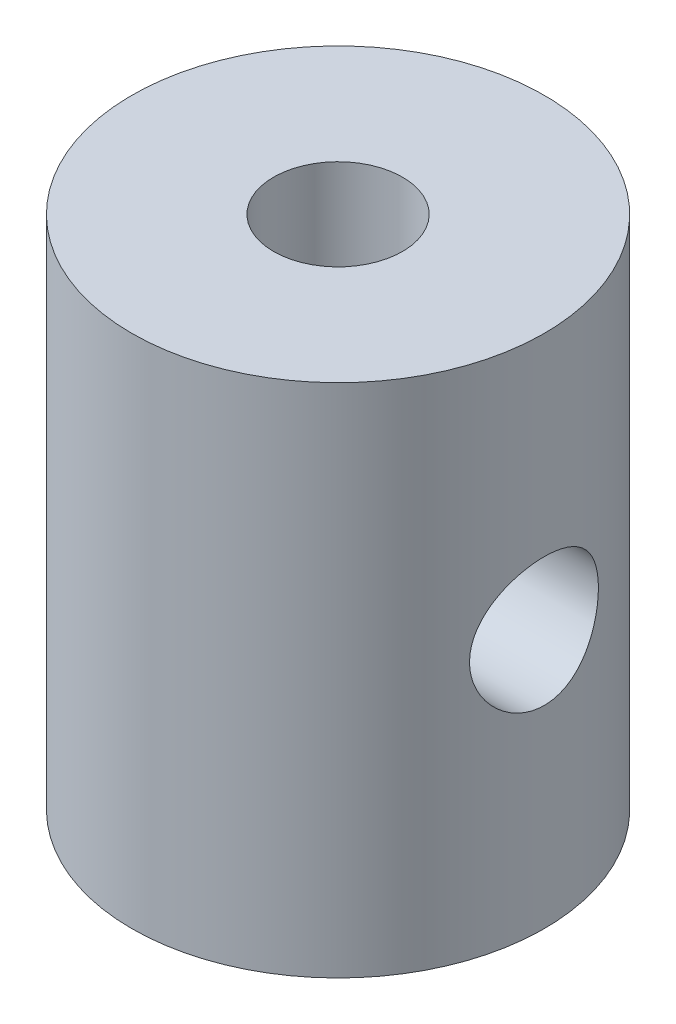
ISO-10303-21;
HEADER;
FILE_DESCRIPTION(('STEP AP214'),'2;1');
FILE_NAME('part.step','',(''),(''),'','','');
FILE_SCHEMA(('AUTOMOTIVE_DESIGN { 1 0 10303 214 1 1 1 1 }'));
ENDSEC;
DATA;
#1=APPLICATION_CONTEXT('core data for automotive mechanical design processes');
#2=APPLICATION_PROTOCOL_DEFINITION('international standard','automotive_design',2000,#1);
#3=PRODUCT_CONTEXT('',#1,'mechanical');
#4=PRODUCT('Part','Part','',(#3));
#5=PRODUCT_RELATED_PRODUCT_CATEGORY('part','',(#4));
#6=PRODUCT_DEFINITION_FORMATION('','',#4);
#7=PRODUCT_DEFINITION_CONTEXT('part definition',#1,'design');
#8=PRODUCT_DEFINITION('design','',#6,#7);
#9=PRODUCT_DEFINITION_SHAPE('','',#8);
#10=(LENGTH_UNIT() NAMED_UNIT(*) SI_UNIT(.MILLI.,.METRE.));
#11=(NAMED_UNIT(*) PLANE_ANGLE_UNIT() SI_UNIT($,.RADIAN.));
#12=(NAMED_UNIT(*) SI_UNIT($,.STERADIAN.) SOLID_ANGLE_UNIT());
#13=UNCERTAINTY_MEASURE_WITH_UNIT(LENGTH_MEASURE(1.E-05),#10,'distance_accuracy_value','');
#14=(GEOMETRIC_REPRESENTATION_CONTEXT(3) GLOBAL_UNCERTAINTY_ASSIGNED_CONTEXT((#13)) GLOBAL_UNIT_ASSIGNED_CONTEXT((#10,
#11,#12)) REPRESENTATION_CONTEXT('',''));
#15=CARTESIAN_POINT('',(0.,0.,0.));
#16=DIRECTION('',(0.,0.,1.));
#17=DIRECTION('',(1.,0.,0.));
#18=AXIS2_PLACEMENT_3D('',#15,#16,#17);
#19=CARTESIAN_POINT('',(0.,-25.,0.));
#20=DIRECTION('',(0.,1.,0.));
#21=DIRECTION('',(0.,0.,1.));
#22=AXIS2_PLACEMENT_3D('',#19,#20,#21);
#23=CYLINDRICAL_SURFACE('',#22,20.);
#24=CARTESIAN_POINT('',(-18.9983551919633,0.,6.25));
#25=CARTESIAN_POINT('',(-18.9983465531433,-0.170946705271578,6.25001220249748));
#26=CARTESIAN_POINT('',(-19.0006674154187,-0.341783917188291,6.24298382337642));
#27=CARTESIAN_POINT('',(-19.0098380991096,-0.682193360819514,6.21500439841195));
#28=CARTESIAN_POINT('',(-19.0166880444432,-0.851765557794165,6.19405297162649));
#29=CARTESIAN_POINT('',(-19.0437922551117,-1.35680341069288,6.11045760257637));
#30=CARTESIAN_POINT('',(-19.070601279309,-1.6888224483215,6.02707232714622));
#31=CARTESIAN_POINT('',(-19.1213838642316,-2.17157806299362,5.86308669824667));
#32=CARTESIAN_POINT('',(-19.1400639547827,-2.32989484003114,5.80197027816337));
#33=CARTESIAN_POINT('',(-19.1803892531402,-2.64073229655452,5.66724355350779));
#34=CARTESIAN_POINT('',(-19.2020334729156,-2.79325488586272,5.59363741017942));
#35=CARTESIAN_POINT('',(-19.2476946669807,-3.09160654413897,5.43443612868291));
#36=CARTESIAN_POINT('',(-19.2717127424668,-3.23743246024447,5.34883541864912));
#37=CARTESIAN_POINT('',(-19.3214496513582,-3.52142717439241,5.16628780678352));
#38=CARTESIAN_POINT('',(-19.3471679379477,-3.65959840828203,5.06934454525522));
#39=CARTESIAN_POINT('',(-19.4004595971661,-3.93175569447389,4.86148478617596));
#40=CARTESIAN_POINT('',(-19.4280658909088,-4.06547254497718,4.75022416007401));
#41=CARTESIAN_POINT('',(-19.4836033679579,-4.32309136727304,4.51702977479153));
#42=CARTESIAN_POINT('',(-19.5115344389149,-4.44699662374714,4.39509961653107));
#43=CARTESIAN_POINT('',(-19.5669901674893,-4.68432778271799,4.14122948858303));
#44=CARTESIAN_POINT('',(-19.5945146146099,-4.79774840705915,4.00928453747628));
#45=CARTESIAN_POINT('',(-19.6483941600851,-5.01326015973406,3.73630200625169));
#46=CARTESIAN_POINT('',(-19.6747496875642,-5.1153554667409,3.59526781033876));
#47=CARTESIAN_POINT('',(-19.726183006,-5.30978251111939,3.30158032384512));
#48=CARTESIAN_POINT('',(-19.7512172637801,-5.4018344985469,3.14873398380246));
#49=CARTESIAN_POINT('',(-19.7986161136991,-5.57265046358953,2.83546853795545));
#50=CARTESIAN_POINT('',(-19.8209817527259,-5.65141965703484,2.67505243643024));
#51=CARTESIAN_POINT('',(-19.8624194989475,-5.79507914699176,2.34766248008238));
#52=CARTESIAN_POINT('',(-19.8814908602071,-5.85996630093437,2.18068715050832));
#53=CARTESIAN_POINT('',(-19.915771077057,-5.9752378671567,1.84149413680952));
#54=CARTESIAN_POINT('',(-19.9309816281762,-6.02562864702366,1.6692787912529));
#55=CARTESIAN_POINT('',(-19.956703029949,-6.11016094243391,1.32615788696706));
#56=CARTESIAN_POINT('',(-19.9673430222219,-6.14475101115604,1.15537246210985));
#57=CARTESIAN_POINT('',(-19.9842770424242,-6.19955722334232,0.81136448477265));
#58=CARTESIAN_POINT('',(-19.9905728235723,-6.21977916553364,0.638142944283742));
#59=CARTESIAN_POINT('',(-19.9986457404025,-6.24567715802093,0.290511267879361));
#60=CARTESIAN_POINT('',(-20.0004228922327,-6.25135326029912,0.116101136213769));
#61=CARTESIAN_POINT('',(-19.9994075510169,-6.24810414747223,-0.232567918489757));
#62=CARTESIAN_POINT('',(-19.9966151496896,-6.23917922543437,-0.406826844492404));
#63=CARTESIAN_POINT('',(-19.9867166560135,-6.20737944811696,-0.747821872327375));
#64=CARTESIAN_POINT('',(-19.9797638641658,-6.18500022007773,-0.914608935515109));
#65=CARTESIAN_POINT('',(-19.9618576854253,-6.12690994895917,-1.24568456133558));
#66=CARTESIAN_POINT('',(-19.9509029395742,-6.09119437711705,-1.40997225548532));
#67=CARTESIAN_POINT('',(-19.9252845680863,-6.00675297505248,-1.73481229471114));
#68=CARTESIAN_POINT('',(-19.9106221480139,-5.95803137350385,-1.8953658354671));
#69=CARTESIAN_POINT('',(-19.8779595027454,-5.84795142242515,-2.21179501201848));
#70=CARTESIAN_POINT('',(-19.8599580211518,-5.78658831527757,-2.36766886123844));
#71=CARTESIAN_POINT('',(-19.8208481861384,-5.65091061625067,-2.67550693721476));
#72=CARTESIAN_POINT('',(-19.7997055241514,-5.57645108046381,-2.82740289014254));
#73=CARTESIAN_POINT('',(-19.755010286847,-5.41561619040245,-3.12444195974527));
#74=CARTESIAN_POINT('',(-19.7314568860971,-5.32923675122587,-3.26958273854929));
#75=CARTESIAN_POINT('',(-19.6825424161091,-5.14517688319552,-3.55219554982278));
#76=CARTESIAN_POINT('',(-19.6571812801215,-5.04749603696069,-3.68966729878325));
#77=CARTESIAN_POINT('',(-19.6052898863413,-4.84146963674816,-3.95613925803904));
#78=CARTESIAN_POINT('',(-19.5787595913802,-4.73312374358481,-4.08513919868368));
#79=CARTESIAN_POINT('',(-19.5240744376208,-4.50168270421633,-4.33913521671951));
#80=CARTESIAN_POINT('',(-19.4958980778718,-4.37815985874525,-4.46373727099592));
#81=CARTESIAN_POINT('',(-19.4397838391742,-4.1210945995929,-4.7021054973933));
#82=CARTESIAN_POINT('',(-19.4118458870911,-3.98755539134112,-4.81587510987803));
#83=CARTESIAN_POINT('',(-19.3569644615262,-3.71118839210567,-5.03193399484999));
#84=CARTESIAN_POINT('',(-19.3300214835286,-3.5683560684989,-5.1342175978437));
#85=CARTESIAN_POINT('',(-19.2779247431301,-3.27441470401229,-5.32649404907026));
#86=CARTESIAN_POINT('',(-19.252770285667,-3.1233089192587,-5.41649168457568));
#87=CARTESIAN_POINT('',(-19.2047007473104,-2.81193170479497,-5.58455021507372));
#88=CARTESIAN_POINT('',(-19.1818151329428,-2.65157407620569,-5.66246001232554));
#89=CARTESIAN_POINT('',(-19.1393421373313,-2.32447802735706,-5.80440117408832));
#90=CARTESIAN_POINT('',(-19.1197534867656,-2.15774209321014,-5.86843788243921));
#91=CARTESIAN_POINT('',(-19.0844973029281,-1.8190378105708,-5.98209888166599));
#92=CARTESIAN_POINT('',(-19.0688293937554,-1.64706996546212,-6.03172455427273));
#93=CARTESIAN_POINT('',(-19.041935564084,-1.2991828529356,-6.11609806257621));
#94=CARTESIAN_POINT('',(-19.0307094472225,-1.123263760558,-6.15084655596916));
#95=CARTESIAN_POINT('',(-19.0134369556036,-0.775979722985899,-6.2040280247837));
#96=CARTESIAN_POINT('',(-19.0072005607674,-0.604715850588751,-6.2230605276928));
#97=CARTESIAN_POINT('',(-18.9993729804696,-0.261097253971547,-6.24691812778686));
#98=CARTESIAN_POINT('',(-18.9977816572401,-0.0887425622559544,-6.25174364633558));
#99=CARTESIAN_POINT('',(-18.9992956652992,0.255730750881421,-6.24714090170111));
#100=CARTESIAN_POINT('',(-19.0024003494644,0.427849401559052,-6.23771460245953));
#101=CARTESIAN_POINT('',(-19.0132046441099,0.77057582547406,-6.20470385117017));
#102=CARTESIAN_POINT('',(-19.0209042101786,0.941183613298445,-6.18111953596609));
#103=CARTESIAN_POINT('',(-19.0403630107192,1.2746878305017,-6.12091032506948));
#104=CARTESIAN_POINT('',(-19.0519973456569,1.43766406792321,-6.08468565903345));
#105=CARTESIAN_POINT('',(-19.0790241777766,1.75996042862001,-5.99940295295346));
#106=CARTESIAN_POINT('',(-19.0944179268405,1.91927931462647,-5.95034063759288));
#107=CARTESIAN_POINT('',(-19.1285146044104,2.23313819185634,-5.83980053432389));
#108=CARTESIAN_POINT('',(-19.1472167598666,2.38767928958009,-5.77832564629177));
#109=CARTESIAN_POINT('',(-19.1874187593882,2.69112769616784,-5.64339574790868));
#110=CARTESIAN_POINT('',(-19.2089196624244,2.8400328448727,-5.56993620020554));
#111=CARTESIAN_POINT('',(-19.2547744768592,3.13539881944071,-5.40932782054134));
#112=CARTESIAN_POINT('',(-19.279191934722,3.2816710402327,-5.32185026228545));
#113=CARTESIAN_POINT('',(-19.3297005353437,3.56643656469879,-5.13536840406701));
#114=CARTESIAN_POINT('',(-19.3557922551127,3.70492715536959,-5.03636012052321));
#115=CARTESIAN_POINT('',(-19.4089431524511,3.97326997750814,-4.82747730660295));
#116=CARTESIAN_POINT('',(-19.4360023882977,4.10312168727073,-4.71760212096488));
#117=CARTESIAN_POINT('',(-19.4903769728969,4.35341484784121,-4.48766755625671));
#118=CARTESIAN_POINT('',(-19.517692326565,4.47385611762315,-4.36760798136503));
#119=CARTESIAN_POINT('',(-19.573003577584,4.7094182643236,-4.11281191669854));
#120=CARTESIAN_POINT('',(-19.6009803693494,4.82410798273259,-3.97767221125868));
#121=CARTESIAN_POINT('',(-19.6556576297955,5.04167262467267,-3.6980279528881));
#122=CARTESIAN_POINT('',(-19.6823585266412,5.1445515281663,-3.55352658044443));
#123=CARTESIAN_POINT('',(-19.7337608125344,5.33783673743838,-3.25599148275346));
#124=CARTESIAN_POINT('',(-19.7584614683101,5.42823847766968,-3.10295466288986));
#125=CARTESIAN_POINT('',(-19.8051490312597,5.59579326028654,-2.78947473823041));
#126=CARTESIAN_POINT('',(-19.827137063129,5.67295179873386,-2.62903474107486));
#127=CARTESIAN_POINT('',(-19.8676443793158,5.8129384127746,-2.30293521036201));
#128=CARTESIAN_POINT('',(-19.8861867632026,5.87586258385019,-2.13731982912445));
#129=CARTESIAN_POINT('',(-19.919455555121,5.98749108921728,-1.80106050220312));
#130=CARTESIAN_POINT('',(-19.9341834889013,6.03620111004339,-1.63041859760079));
#131=CARTESIAN_POINT('',(-19.9594057706359,6.11898148764016,-1.2853207629928));
#132=CARTESIAN_POINT('',(-19.9699003700916,6.15305271410625,-1.11086506021339));
#133=CARTESIAN_POINT('',(-19.9863484456388,6.20622798601326,-0.759477308413848));
#134=CARTESIAN_POINT('',(-19.9923020890974,6.22533258308357,-0.582545350906421));
#135=CARTESIAN_POINT('',(-19.9993422773599,6.24790354853671,-0.235033707038716));
#136=CARTESIAN_POINT('',(-20.0006220309992,6.251990749793,-0.0644979603061772));
#137=CARTESIAN_POINT('',(-19.9988168213832,6.24621346145444,0.276374094750739));
#138=CARTESIAN_POINT('',(-19.9957303662777,6.2363442032039,0.446710314995391));
#139=CARTESIAN_POINT('',(-19.9852766158365,6.20274415975641,0.785799605142488));
#140=CARTESIAN_POINT('',(-19.9779111956206,6.17901944624565,0.954553335625939));
#141=CARTESIAN_POINT('',(-19.9590974695587,6.11791761636516,1.28940274290464));
#142=CARTESIAN_POINT('',(-19.9476476393044,6.0805354025338,1.45549740304885));
#143=CARTESIAN_POINT('',(-19.9211459196679,5.99301834966943,1.78167799666709));
#144=CARTESIAN_POINT('',(-19.9061424905935,5.94305455132231,1.94181384189645));
#145=CARTESIAN_POINT('',(-19.8728392048503,5.83053388743712,2.25730693260683));
#146=CARTESIAN_POINT('',(-19.8545381650437,5.76797250110632,2.41266243946872));
#147=CARTESIAN_POINT('',(-19.8151128937664,5.63076493394928,2.71752126958431));
#148=CARTESIAN_POINT('',(-19.7939893245355,5.55612158700378,2.86702595498905));
#149=CARTESIAN_POINT('',(-19.7494360244408,5.39524765747288,3.1593752660057));
#150=CARTESIAN_POINT('',(-19.7260054218279,5.30901269028079,3.30221734376755));
#151=CARTESIAN_POINT('',(-19.676608123822,5.12247631782803,3.58502218162572));
#152=CARTESIAN_POINT('',(-19.6505827091939,5.02179999086887,3.72472746839389));
#153=CARTESIAN_POINT('',(-19.5973670398604,4.80935251038556,3.99527515481778));
#154=CARTESIAN_POINT('',(-19.5701763543027,4.69757723261476,4.12611422927451));
#155=CARTESIAN_POINT('',(-19.5153545735626,4.46368512113175,4.37807721298121));
#156=CARTESIAN_POINT('',(-19.4877235137074,4.34156911360359,4.49920189687041));
#157=CARTESIAN_POINT('',(-19.4327394146794,4.08769150398527,4.73105083236208));
#158=CARTESIAN_POINT('',(-19.4053864825343,3.95592633766691,4.84177120596487));
#159=CARTESIAN_POINT('',(-19.3508170632106,3.67908069192296,5.05553649772916));
#160=CARTESIAN_POINT('',(-19.3236349029421,3.53370421176823,5.15820726681043));
#161=CARTESIAN_POINT('',(-19.2711617473899,3.23448080903275,5.35091598511759));
#162=CARTESIAN_POINT('',(-19.2458707493969,3.08063389858766,5.44095395244198));
#163=CARTESIAN_POINT('',(-19.197954076567,2.76553298728248,5.60768092920831));
#164=CARTESIAN_POINT('',(-19.1753275222045,2.6042814552368,5.68437434766564));
#165=CARTESIAN_POINT('',(-19.1334400730414,2.27543930159231,5.82381079748696));
#166=CARTESIAN_POINT('',(-19.1141789761794,2.10784906130373,5.8865546664408));
#167=CARTESIAN_POINT('',(-19.0811240689911,1.7820595978294,5.99279075623233));
#168=CARTESIAN_POINT('',(-19.0670037940281,1.62428093249023,6.03746959463562));
#169=CARTESIAN_POINT('',(-19.0424864173646,1.30543649851357,6.11435149551778));
#170=CARTESIAN_POINT('',(-19.0320902966728,1.14436987556204,6.14655127097129));
#171=CARTESIAN_POINT('',(-19.0070026153044,0.657860923215882,6.22391789442981));
#172=CARTESIAN_POINT('',(-18.9983718042881,0.328728015359674,6.24997653477572));
#173=CARTESIAN_POINT('',(-18.9983551919633,0.,6.25));
#174=B_SPLINE_CURVE_WITH_KNOTS('',3,(#24,#25,#26,#27,#28,#29,#30,#31,#32,#33,#34,#35,#36,#37,
#38,#39,#40,#41,#42,#43,#44,#45,#46,#47,#48,#49,#50,#51,#52,#53,#54,#55,#56,#57,#58,#59,#60,#61,
#62,#63,#64,#65,#66,#67,#68,#69,#70,#71,#72,#73,#74,#75,#76,#77,#78,#79,#80,#81,#82,#83,#84,#85,
#86,#87,#88,#89,#90,#91,#92,#93,#94,#95,#96,#97,#98,#99,#100,#101,#102,#103,#104,#105,#106,#107,
#108,#109,#110,#111,#112,#113,#114,#115,#116,#117,#118,#119,#120,#121,#122,#123,#124,#125,#126,
#127,#128,#129,#130,#131,#132,#133,#134,#135,#136,#137,#138,#139,#140,#141,#142,#143,#144,#145,
#146,#147,#148,#149,#150,#151,#152,#153,#154,#155,#156,#157,#158,#159,#160,#161,#162,#163,#164,
#165,#166,#167,#168,#169,#170,#171,#172,#173),.UNSPECIFIED.,.T.,.F.,(4,2,2,2,2,2,2,2,2,2,2,2,2,
2,2,2,2,2,2,2,2,2,2,2,2,2,2,2,2,2,2,2,2,2,2,2,2,2,2,2,2,2,2,2,2,2,2,2,2,2,2,2,2,2,2,2,2,2,2,2,2,
2,2,2,2,2,2,2,2,2,2,2,2,2,4),(0.,0.512463459196137,1.02494094024432,2.04920838780054,
2.56096006012822,3.07254156398072,3.58436150678937,4.09601763324921,4.623801570179,
5.15140806433755,5.67927873504597,6.2069539862609,6.7468087832914,7.28645109632092,
7.82621544278535,8.36574233243012,8.88882075058801,9.41168794325543,9.93455326735869,
10.4574080968005,10.9620905035015,11.4669444466127,11.9716344451554,12.4765147313852,
12.9873816070187,13.4984239914351,14.0094852555846,14.5205627785179,15.0530471230793,
15.5853617834977,16.1179380500676,16.6503062003638,17.1888696111152,17.7272251997962,
18.2655291538601,18.8038093079127,19.3204586160891,19.8370926008529,20.3536553984517,
20.8702132033149,21.3717113195805,21.8733766625787,22.3749249397827,22.8766635440252,
23.3926093829403,23.9087340001481,24.4248897580693,24.9410554426889,25.4787406676206,
26.016244170317,26.5539438336461,27.0914198037922,27.625151164556,28.1586687062804,
28.6921545471735,29.2256207242996,29.7367676790304,30.2480893251187,30.7591870696862,
31.2704757691932,31.7751572512878,32.2800201680805,32.7847648380431,33.2897009710996,
33.8115813093835,34.3336563035074,34.8556896251556,35.3779167588895,35.9173873050154,
36.456857078256,36.9961482717797,37.5354070752326,38.0286050955105,38.5219329375832,
39.5073926784905),.UNSPECIFIED.);
#175=CARTESIAN_POINT('',(-18.9983551919633,0.,6.25));
#176=VERTEX_POINT('',#175);
#177=EDGE_CURVE('E57',#176,#176,#174,.T.);
#178=ORIENTED_EDGE('',*,*,#177,.T.);
#179=EDGE_LOOP('',(#178));
#180=FACE_BOUND('',#179,.T.);
#181=CARTESIAN_POINT('',(0.,-25.,0.));
#182=DIRECTION('',(0.,1.,0.));
#183=DIRECTION('',(0.,0.,1.));
#184=AXIS2_PLACEMENT_3D('',#181,#182,#183);
#185=CIRCLE('',#184,20.);
#186=CARTESIAN_POINT('',(0.,-25.,20.));
#187=VERTEX_POINT('',#186);
#188=EDGE_CURVE('E10',#187,#187,#185,.T.);
#189=ORIENTED_EDGE('',*,*,#188,.T.);
#190=EDGE_LOOP('',(#189));
#191=FACE_BOUND('',#190,.T.);
#192=CARTESIAN_POINT('',(0.,25.,0.));
#193=DIRECTION('',(0.,1.,0.));
#194=DIRECTION('',(0.,0.,1.));
#195=AXIS2_PLACEMENT_3D('',#192,#193,#194);
#196=CIRCLE('',#195,20.);
#197=CARTESIAN_POINT('',(0.,25.,20.));
#198=VERTEX_POINT('',#197);
#199=EDGE_CURVE('E49',#198,#198,#196,.T.);
#200=ORIENTED_EDGE('',*,*,#199,.F.);
#201=EDGE_LOOP('',(#200));
#202=FACE_BOUND('',#201,.T.);
#203=CARTESIAN_POINT('',(18.9983551919633,0.,6.25));
#204=CARTESIAN_POINT('',(18.9983465531433,0.170946705271578,6.25001220249748));
#205=CARTESIAN_POINT('',(19.0006674154187,0.341783917188291,6.24298382337642));
#206=CARTESIAN_POINT('',(19.0098380991096,0.682193360819514,6.21500439841195));
#207=CARTESIAN_POINT('',(19.0166880444432,0.851765557794165,6.19405297162649));
#208=CARTESIAN_POINT('',(19.0437922551117,1.35680341069288,6.11045760257637));
#209=CARTESIAN_POINT('',(19.070601279309,1.6888224483215,6.02707232714622));
#210=CARTESIAN_POINT('',(19.1213838642316,2.17157806299362,5.86308669824667));
#211=CARTESIAN_POINT('',(19.1400639547827,2.32989484003114,5.80197027816337));
#212=CARTESIAN_POINT('',(19.1803892531402,2.64073229655452,5.66724355350779));
#213=CARTESIAN_POINT('',(19.2020334729156,2.79325488586272,5.59363741017942));
#214=CARTESIAN_POINT('',(19.2476946669807,3.09160654413897,5.43443612868291));
#215=CARTESIAN_POINT('',(19.2717127424668,3.23743246024447,5.34883541864912));
#216=CARTESIAN_POINT('',(19.3214496513582,3.52142717439241,5.16628780678352));
#217=CARTESIAN_POINT('',(19.3471679379477,3.65959840828203,5.06934454525522));
#218=CARTESIAN_POINT('',(19.4004595971661,3.93175569447389,4.86148478617596));
#219=CARTESIAN_POINT('',(19.4280658909088,4.06547254497718,4.75022416007401));
#220=CARTESIAN_POINT('',(19.4836033679579,4.32309136727304,4.51702977479153));
#221=CARTESIAN_POINT('',(19.5115344389149,4.44699662374714,4.39509961653107));
#222=CARTESIAN_POINT('',(19.5669901674893,4.68432778271799,4.14122948858303));
#223=CARTESIAN_POINT('',(19.5945146146099,4.79774840705915,4.00928453747628));
#224=CARTESIAN_POINT('',(19.6483941600851,5.01326015973406,3.73630200625169));
#225=CARTESIAN_POINT('',(19.6747496875642,5.1153554667409,3.59526781033876));
#226=CARTESIAN_POINT('',(19.726183006,5.30978251111939,3.30158032384512));
#227=CARTESIAN_POINT('',(19.7512172637801,5.4018344985469,3.14873398380246));
#228=CARTESIAN_POINT('',(19.7986161136991,5.57265046358953,2.83546853795545));
#229=CARTESIAN_POINT('',(19.8209817527259,5.65141965703484,2.67505243643024));
#230=CARTESIAN_POINT('',(19.8624194989475,5.79507914699176,2.34766248008238));
#231=CARTESIAN_POINT('',(19.8814908602071,5.85996630093437,2.18068715050832));
#232=CARTESIAN_POINT('',(19.915771077057,5.9752378671567,1.84149413680952));
#233=CARTESIAN_POINT('',(19.9309816281762,6.02562864702366,1.6692787912529));
#234=CARTESIAN_POINT('',(19.956703029949,6.11016094243391,1.32615788696706));
#235=CARTESIAN_POINT('',(19.9673430222219,6.14475101115604,1.15537246210985));
#236=CARTESIAN_POINT('',(19.9842770424242,6.19955722334232,0.81136448477265));
#237=CARTESIAN_POINT('',(19.9905728235723,6.21977916553364,0.638142944283742));
#238=CARTESIAN_POINT('',(19.9986457404025,6.24567715802093,0.290511267879361));
#239=CARTESIAN_POINT('',(20.0004228922327,6.25135326029912,0.116101136213769));
#240=CARTESIAN_POINT('',(19.9994075510169,6.24810414747223,-0.232567918489757));
#241=CARTESIAN_POINT('',(19.9966151496896,6.23917922543437,-0.406826844492404));
#242=CARTESIAN_POINT('',(19.9867166560135,6.20737944811696,-0.747821872327375));
#243=CARTESIAN_POINT('',(19.9797638641658,6.18500022007773,-0.914608935515109));
#244=CARTESIAN_POINT('',(19.9618576854253,6.12690994895917,-1.24568456133558));
#245=CARTESIAN_POINT('',(19.9509029395742,6.09119437711705,-1.40997225548532));
#246=CARTESIAN_POINT('',(19.9252845680863,6.00675297505248,-1.73481229471114));
#247=CARTESIAN_POINT('',(19.9106221480139,5.95803137350385,-1.8953658354671));
#248=CARTESIAN_POINT('',(19.8779595027454,5.84795142242515,-2.21179501201848));
#249=CARTESIAN_POINT('',(19.8599580211518,5.78658831527757,-2.36766886123844));
#250=CARTESIAN_POINT('',(19.8208481861384,5.65091061625067,-2.67550693721476));
#251=CARTESIAN_POINT('',(19.7997055241514,5.57645108046381,-2.82740289014254));
#252=CARTESIAN_POINT('',(19.755010286847,5.41561619040245,-3.12444195974527));
#253=CARTESIAN_POINT('',(19.7314568860971,5.32923675122587,-3.26958273854929));
#254=CARTESIAN_POINT('',(19.6825424161091,5.14517688319552,-3.55219554982278));
#255=CARTESIAN_POINT('',(19.6571812801215,5.04749603696069,-3.68966729878325));
#256=CARTESIAN_POINT('',(19.6052898863413,4.84146963674816,-3.95613925803904));
#257=CARTESIAN_POINT('',(19.5787595913802,4.73312374358481,-4.08513919868368));
#258=CARTESIAN_POINT('',(19.5240744376208,4.50168270421633,-4.33913521671951));
#259=CARTESIAN_POINT('',(19.4958980778718,4.37815985874525,-4.46373727099592));
#260=CARTESIAN_POINT('',(19.4397838391742,4.1210945995929,-4.7021054973933));
#261=CARTESIAN_POINT('',(19.4118458870911,3.98755539134112,-4.81587510987803));
#262=CARTESIAN_POINT('',(19.3569644615262,3.71118839210567,-5.03193399484999));
#263=CARTESIAN_POINT('',(19.3300214835286,3.5683560684989,-5.1342175978437));
#264=CARTESIAN_POINT('',(19.2779247431301,3.27441470401229,-5.32649404907026));
#265=CARTESIAN_POINT('',(19.252770285667,3.1233089192587,-5.41649168457568));
#266=CARTESIAN_POINT('',(19.2047007473104,2.81193170479497,-5.58455021507372));
#267=CARTESIAN_POINT('',(19.1818151329428,2.65157407620569,-5.66246001232554));
#268=CARTESIAN_POINT('',(19.1393421373313,2.32447802735706,-5.80440117408832));
#269=CARTESIAN_POINT('',(19.1197534867656,2.15774209321014,-5.86843788243921));
#270=CARTESIAN_POINT('',(19.0844973029281,1.8190378105708,-5.98209888166599));
#271=CARTESIAN_POINT('',(19.0688293937554,1.64706996546212,-6.03172455427273));
#272=CARTESIAN_POINT('',(19.041935564084,1.2991828529356,-6.11609806257621));
#273=CARTESIAN_POINT('',(19.0307094472225,1.123263760558,-6.15084655596916));
#274=CARTESIAN_POINT('',(19.0134369556036,0.775979722985899,-6.2040280247837));
#275=CARTESIAN_POINT('',(19.0072005607674,0.604715850588751,-6.2230605276928));
#276=CARTESIAN_POINT('',(18.9993729804696,0.261097253971547,-6.24691812778686));
#277=CARTESIAN_POINT('',(18.9977816572401,0.0887425622559544,-6.25174364633558));
#278=CARTESIAN_POINT('',(18.9992956652992,-0.255730750881421,-6.24714090170111));
#279=CARTESIAN_POINT('',(19.0024003494644,-0.427849401559052,-6.23771460245953));
#280=CARTESIAN_POINT('',(19.0132046441099,-0.77057582547406,-6.20470385117017));
#281=CARTESIAN_POINT('',(19.0209042101786,-0.941183613298445,-6.18111953596609));
#282=CARTESIAN_POINT('',(19.0403630107192,-1.2746878305017,-6.12091032506948));
#283=CARTESIAN_POINT('',(19.0519973456569,-1.43766406792321,-6.08468565903345));
#284=CARTESIAN_POINT('',(19.0790241777766,-1.75996042862001,-5.99940295295346));
#285=CARTESIAN_POINT('',(19.0944179268405,-1.91927931462647,-5.95034063759288));
#286=CARTESIAN_POINT('',(19.1285146044104,-2.23313819185634,-5.83980053432389));
#287=CARTESIAN_POINT('',(19.1472167598666,-2.38767928958009,-5.77832564629177));
#288=CARTESIAN_POINT('',(19.1874187593882,-2.69112769616784,-5.64339574790868));
#289=CARTESIAN_POINT('',(19.2089196624244,-2.8400328448727,-5.56993620020554));
#290=CARTESIAN_POINT('',(19.2547744768592,-3.13539881944071,-5.40932782054134));
#291=CARTESIAN_POINT('',(19.279191934722,-3.2816710402327,-5.32185026228545));
#292=CARTESIAN_POINT('',(19.3297005353437,-3.56643656469879,-5.13536840406701));
#293=CARTESIAN_POINT('',(19.3557922551127,-3.70492715536959,-5.03636012052321));
#294=CARTESIAN_POINT('',(19.4089431524511,-3.97326997750814,-4.82747730660295));
#295=CARTESIAN_POINT('',(19.4360023882977,-4.10312168727073,-4.71760212096488));
#296=CARTESIAN_POINT('',(19.4903769728969,-4.35341484784121,-4.48766755625671));
#297=CARTESIAN_POINT('',(19.517692326565,-4.47385611762315,-4.36760798136503));
#298=CARTESIAN_POINT('',(19.573003577584,-4.7094182643236,-4.11281191669854));
#299=CARTESIAN_POINT('',(19.6009803693494,-4.82410798273259,-3.97767221125868));
#300=CARTESIAN_POINT('',(19.6556576297955,-5.04167262467267,-3.6980279528881));
#301=CARTESIAN_POINT('',(19.6823585266412,-5.1445515281663,-3.55352658044443));
#302=CARTESIAN_POINT('',(19.7337608125344,-5.33783673743838,-3.25599148275346));
#303=CARTESIAN_POINT('',(19.7584614683101,-5.42823847766968,-3.10295466288986));
#304=CARTESIAN_POINT('',(19.8051490312597,-5.59579326028654,-2.78947473823041));
#305=CARTESIAN_POINT('',(19.827137063129,-5.67295179873386,-2.62903474107486));
#306=CARTESIAN_POINT('',(19.8676443793158,-5.8129384127746,-2.30293521036201));
#307=CARTESIAN_POINT('',(19.8861867632026,-5.87586258385019,-2.13731982912445));
#308=CARTESIAN_POINT('',(19.919455555121,-5.98749108921728,-1.80106050220312));
#309=CARTESIAN_POINT('',(19.9341834889013,-6.03620111004339,-1.63041859760079));
#310=CARTESIAN_POINT('',(19.9594057706359,-6.11898148764016,-1.2853207629928));
#311=CARTESIAN_POINT('',(19.9699003700916,-6.15305271410625,-1.11086506021339));
#312=CARTESIAN_POINT('',(19.9863484456388,-6.20622798601326,-0.759477308413848));
#313=CARTESIAN_POINT('',(19.9923020890974,-6.22533258308357,-0.582545350906421));
#314=CARTESIAN_POINT('',(19.9993422773599,-6.24790354853671,-0.235033707038716));
#315=CARTESIAN_POINT('',(20.0006220309992,-6.251990749793,-0.0644979603061772));
#316=CARTESIAN_POINT('',(19.9988168213832,-6.24621346145444,0.276374094750739));
#317=CARTESIAN_POINT('',(19.9957303662777,-6.2363442032039,0.446710314995391));
#318=CARTESIAN_POINT('',(19.9852766158365,-6.20274415975641,0.785799605142488));
#319=CARTESIAN_POINT('',(19.9779111956206,-6.17901944624565,0.954553335625939));
#320=CARTESIAN_POINT('',(19.9590974695587,-6.11791761636516,1.28940274290464));
#321=CARTESIAN_POINT('',(19.9476476393044,-6.0805354025338,1.45549740304885));
#322=CARTESIAN_POINT('',(19.9211459196679,-5.99301834966943,1.78167799666709));
#323=CARTESIAN_POINT('',(19.9061424905935,-5.94305455132231,1.94181384189645));
#324=CARTESIAN_POINT('',(19.8728392048503,-5.83053388743712,2.25730693260683));
#325=CARTESIAN_POINT('',(19.8545381650437,-5.76797250110632,2.41266243946872));
#326=CARTESIAN_POINT('',(19.8151128937664,-5.63076493394928,2.71752126958431));
#327=CARTESIAN_POINT('',(19.7939893245355,-5.55612158700378,2.86702595498905));
#328=CARTESIAN_POINT('',(19.7494360244408,-5.39524765747288,3.1593752660057));
#329=CARTESIAN_POINT('',(19.7260054218279,-5.30901269028079,3.30221734376755));
#330=CARTESIAN_POINT('',(19.676608123822,-5.12247631782803,3.58502218162572));
#331=CARTESIAN_POINT('',(19.6505827091939,-5.02179999086887,3.72472746839389));
#332=CARTESIAN_POINT('',(19.5973670398604,-4.80935251038556,3.99527515481778));
#333=CARTESIAN_POINT('',(19.5701763543027,-4.69757723261476,4.12611422927451));
#334=CARTESIAN_POINT('',(19.5153545735626,-4.46368512113175,4.37807721298121));
#335=CARTESIAN_POINT('',(19.4877235137074,-4.34156911360359,4.49920189687041));
#336=CARTESIAN_POINT('',(19.4327394146794,-4.08769150398527,4.73105083236208));
#337=CARTESIAN_POINT('',(19.4053864825343,-3.95592633766691,4.84177120596487));
#338=CARTESIAN_POINT('',(19.3508170632106,-3.67908069192296,5.05553649772916));
#339=CARTESIAN_POINT('',(19.3236349029421,-3.53370421176823,5.15820726681043));
#340=CARTESIAN_POINT('',(19.2711617473899,-3.23448080903275,5.35091598511759));
#341=CARTESIAN_POINT('',(19.2458707493969,-3.08063389858766,5.44095395244198));
#342=CARTESIAN_POINT('',(19.197954076567,-2.76553298728248,5.60768092920831));
#343=CARTESIAN_POINT('',(19.1753275222045,-2.6042814552368,5.68437434766564));
#344=CARTESIAN_POINT('',(19.1334400730414,-2.27543930159231,5.82381079748696));
#345=CARTESIAN_POINT('',(19.1141789761794,-2.10784906130373,5.8865546664408));
#346=CARTESIAN_POINT('',(19.0811240689911,-1.7820595978294,5.99279075623233));
#347=CARTESIAN_POINT('',(19.0670037940281,-1.62428093249023,6.03746959463562));
#348=CARTESIAN_POINT('',(19.0424864173646,-1.30543649851357,6.11435149551778));
#349=CARTESIAN_POINT('',(19.0320902966728,-1.14436987556204,6.14655127097129));
#350=CARTESIAN_POINT('',(19.0070026153044,-0.657860923215882,6.22391789442981));
#351=CARTESIAN_POINT('',(18.9983718042881,-0.328728015359674,6.24997653477572));
#352=CARTESIAN_POINT('',(18.9983551919633,0.,6.25));
#353=B_SPLINE_CURVE_WITH_KNOTS('',3,(#203,#204,#205,#206,#207,#208,#209,#210,#211,#212,#213,
#214,#215,#216,#217,#218,#219,#220,#221,#222,#223,#224,#225,#226,#227,#228,#229,#230,#231,#232,
#233,#234,#235,#236,#237,#238,#239,#240,#241,#242,#243,#244,#245,#246,#247,#248,#249,#250,#251,
#252,#253,#254,#255,#256,#257,#258,#259,#260,#261,#262,#263,#264,#265,#266,#267,#268,#269,#270,
#271,#272,#273,#274,#275,#276,#277,#278,#279,#280,#281,#282,#283,#284,#285,#286,#287,#288,#289,
#290,#291,#292,#293,#294,#295,#296,#297,#298,#299,#300,#301,#302,#303,#304,#305,#306,#307,#308,
#309,#310,#311,#312,#313,#314,#315,#316,#317,#318,#319,#320,#321,#322,#323,#324,#325,#326,#327,
#328,#329,#330,#331,#332,#333,#334,#335,#336,#337,#338,#339,#340,#341,#342,#343,#344,#345,#346,
#347,#348,#349,#350,#351,#352),.UNSPECIFIED.,.T.,.F.,(4,2,2,2,2,2,2,2,2,2,2,2,2,2,2,2,2,2,2,2,2,
2,2,2,2,2,2,2,2,2,2,2,2,2,2,2,2,2,2,2,2,2,2,2,2,2,2,2,2,2,2,2,2,2,2,2,2,2,2,2,2,2,2,2,2,2,2,2,2,
2,2,2,2,2,4),(0.,0.512463459196137,1.02494094024432,2.04920838780054,2.56096006012822,
3.07254156398072,3.58436150678937,4.09601763324921,4.623801570179,5.15140806433755,
5.67927873504597,6.2069539862609,6.7468087832914,7.28645109632092,7.82621544278535,
8.36574233243012,8.88882075058801,9.41168794325543,9.93455326735869,10.4574080968005,
10.9620905035015,11.4669444466127,11.9716344451554,12.4765147313852,12.9873816070187,
13.4984239914351,14.0094852555846,14.5205627785179,15.0530471230793,15.5853617834977,
16.1179380500676,16.6503062003638,17.1888696111152,17.7272251997962,18.2655291538601,
18.8038093079127,19.3204586160891,19.8370926008529,20.3536553984517,20.8702132033149,
21.3717113195805,21.8733766625787,22.3749249397827,22.8766635440252,23.3926093829403,
23.9087340001481,24.4248897580693,24.9410554426889,25.4787406676206,26.016244170317,
26.5539438336461,27.0914198037922,27.625151164556,28.1586687062804,28.6921545471735,
29.2256207242996,29.7367676790304,30.2480893251187,30.7591870696862,31.2704757691932,
31.7751572512878,32.2800201680805,32.7847648380431,33.2897009710996,33.8115813093835,
34.3336563035074,34.8556896251556,35.3779167588895,35.9173873050154,36.456857078256,
36.9961482717797,37.5354070752326,38.0286050955105,38.5219329375832,39.5073926784905),.UNSPECIFIED.);
#354=CARTESIAN_POINT('',(18.9983551919633,0.,6.25));
#355=VERTEX_POINT('',#354);
#356=EDGE_CURVE('E40',#355,#355,#353,.T.);
#357=ORIENTED_EDGE('',*,*,#356,.T.);
#358=EDGE_LOOP('',(#357));
#359=FACE_BOUND('',#358,.T.);
#360=ADVANCED_FACE('F36',(#180,#191,#202,#359),#23,.T.);
#361=CARTESIAN_POINT('',(0.,-25.,0.));
#362=DIRECTION('',(0.,1.,0.));
#363=DIRECTION('',(0.,0.,1.));
#364=AXIS2_PLACEMENT_3D('',#361,#362,#363);
#365=PLANE('',#364);
#366=CARTESIAN_POINT('',(0.,-25.,0.));
#367=DIRECTION('',(0.,1.,0.));
#368=DIRECTION('',(0.,0.,1.));
#369=AXIS2_PLACEMENT_3D('',#366,#367,#368);
#370=CIRCLE('',#369,6.25);
#371=CARTESIAN_POINT('',(0.,-25.,6.25));
#372=VERTEX_POINT('',#371);
#373=EDGE_CURVE('E86',#372,#372,#370,.T.);
#374=ORIENTED_EDGE('',*,*,#373,.T.);
#375=EDGE_LOOP('',(#374));
#376=FACE_BOUND('',#375,.T.);
#377=ORIENTED_EDGE('',*,*,#188,.F.);
#378=EDGE_LOOP('',(#377));
#379=FACE_BOUND('',#378,.T.);
#380=ADVANCED_FACE('F75',(#376,#379),#365,.F.);
#381=CARTESIAN_POINT('',(0.,25.,0.));
#382=DIRECTION('',(0.,1.,0.));
#383=DIRECTION('',(0.,0.,1.));
#384=AXIS2_PLACEMENT_3D('',#381,#382,#383);
#385=PLANE('',#384);
#386=CARTESIAN_POINT('',(0.,25.,0.));
#387=DIRECTION('',(0.,1.,0.));
#388=DIRECTION('',(0.,0.,1.));
#389=AXIS2_PLACEMENT_3D('',#386,#387,#388);
#390=CIRCLE('',#389,6.25);
#391=CARTESIAN_POINT('',(0.,25.,6.25));
#392=VERTEX_POINT('',#391);
#393=EDGE_CURVE('E93',#392,#392,#390,.T.);
#394=ORIENTED_EDGE('',*,*,#393,.F.);
#395=EDGE_LOOP('',(#394));
#396=FACE_BOUND('',#395,.T.);
#397=ORIENTED_EDGE('',*,*,#199,.T.);
#398=EDGE_LOOP('',(#397));
#399=FACE_BOUND('',#398,.T.);
#400=ADVANCED_FACE('F70',(#396,#399),#385,.T.);
#401=CARTESIAN_POINT('',(40.,0.,0.));
#402=DIRECTION('',(-1.,0.,0.));
#403=DIRECTION('',(0.,0.,1.));
#404=AXIS2_PLACEMENT_3D('',#401,#402,#403);
#405=CYLINDRICAL_SURFACE('',#404,6.25);
#406=ORIENTED_EDGE('',*,*,#356,.F.);
#407=EDGE_LOOP('',(#406));
#408=FACE_BOUND('',#407,.T.);
#409=ORIENTED_EDGE('',*,*,#177,.F.);
#410=EDGE_LOOP('',(#409));
#411=FACE_BOUND('',#410,.T.);
#412=ADVANCED_FACE('F64',(#408,#411),#405,.F.);
#413=CARTESIAN_POINT('',(0.,12.5,0.));
#414=DIRECTION('',(0.,1.,0.));
#415=DIRECTION('',(0.,0.,1.));
#416=AXIS2_PLACEMENT_3D('',#413,#414,#415);
#417=CYLINDRICAL_SURFACE('',#416,6.25);
#418=CARTESIAN_POINT('',(0.,12.5,0.));
#419=DIRECTION('',(0.,1.,0.));
#420=DIRECTION('',(0.,0.,1.));
#421=AXIS2_PLACEMENT_3D('',#418,#419,#420);
#422=CIRCLE('',#421,6.25);
#423=CARTESIAN_POINT('',(0.,12.5,6.25));
#424=VERTEX_POINT('',#423);
#425=EDGE_CURVE('E63',#424,#424,#422,.T.);
#426=ORIENTED_EDGE('',*,*,#425,.F.);
#427=EDGE_LOOP('',(#426));
#428=FACE_BOUND('',#427,.T.);
#429=ORIENTED_EDGE('',*,*,#393,.T.);
#430=EDGE_LOOP('',(#429));
#431=FACE_BOUND('',#430,.T.);
#432=ADVANCED_FACE('F69',(#428,#431),#417,.F.);
#433=CARTESIAN_POINT('',(0.,12.5,0.));
#434=DIRECTION('',(0.,1.,0.));
#435=DIRECTION('',(0.,0.,1.));
#436=AXIS2_PLACEMENT_3D('',#433,#434,#435);
#437=PLANE('',#436);
#438=ORIENTED_EDGE('',*,*,#425,.T.);
#439=EDGE_LOOP('',(#438));
#440=FACE_BOUND('',#439,.T.);
#441=ADVANCED_FACE('F112',(#440),#437,.T.);
#442=CARTESIAN_POINT('',(0.,-12.5,0.));
#443=DIRECTION('',(0.,-1.,0.));
#444=DIRECTION('',(0.,0.,-1.));
#445=AXIS2_PLACEMENT_3D('',#442,#443,#444);
#446=CYLINDRICAL_SURFACE('',#445,6.25);
#447=CARTESIAN_POINT('',(0.,-12.5,0.));
#448=DIRECTION('',(0.,1.,0.));
#449=DIRECTION('',(0.,0.,1.));
#450=AXIS2_PLACEMENT_3D('',#447,#448,#449);
#451=CIRCLE('',#450,6.25);
#452=CARTESIAN_POINT('',(0.,-12.5,6.25));
#453=VERTEX_POINT('',#452);
#454=EDGE_CURVE('E89',#453,#453,#451,.T.);
#455=ORIENTED_EDGE('',*,*,#454,.T.);
#456=EDGE_LOOP('',(#455));
#457=FACE_BOUND('',#456,.T.);
#458=ORIENTED_EDGE('',*,*,#373,.F.);
#459=EDGE_LOOP('',(#458));
#460=FACE_BOUND('',#459,.T.);
#461=ADVANCED_FACE('F117',(#457,#460),#446,.F.);
#462=CARTESIAN_POINT('',(0.,-12.5,0.));
#463=DIRECTION('',(0.,-1.,0.));
#464=DIRECTION('',(0.,0.,1.));
#465=AXIS2_PLACEMENT_3D('',#462,#463,#464);
#466=PLANE('',#465);
#467=ORIENTED_EDGE('',*,*,#454,.F.);
#468=EDGE_LOOP('',(#467));
#469=FACE_BOUND('',#468,.T.);
#470=ADVANCED_FACE('F123',(#469),#466,.T.);
#471=CLOSED_SHELL('',(#360,#380,#400,#412,#432,#441,#461,#470));
#472=MANIFOLD_SOLID_BREP('B2',#471);
#473=ADVANCED_BREP_SHAPE_REPRESENTATION('',(#18,#472),#14);
#474=SHAPE_DEFINITION_REPRESENTATION(#9,#473);
ENDSEC;
END-ISO-10303-21;
